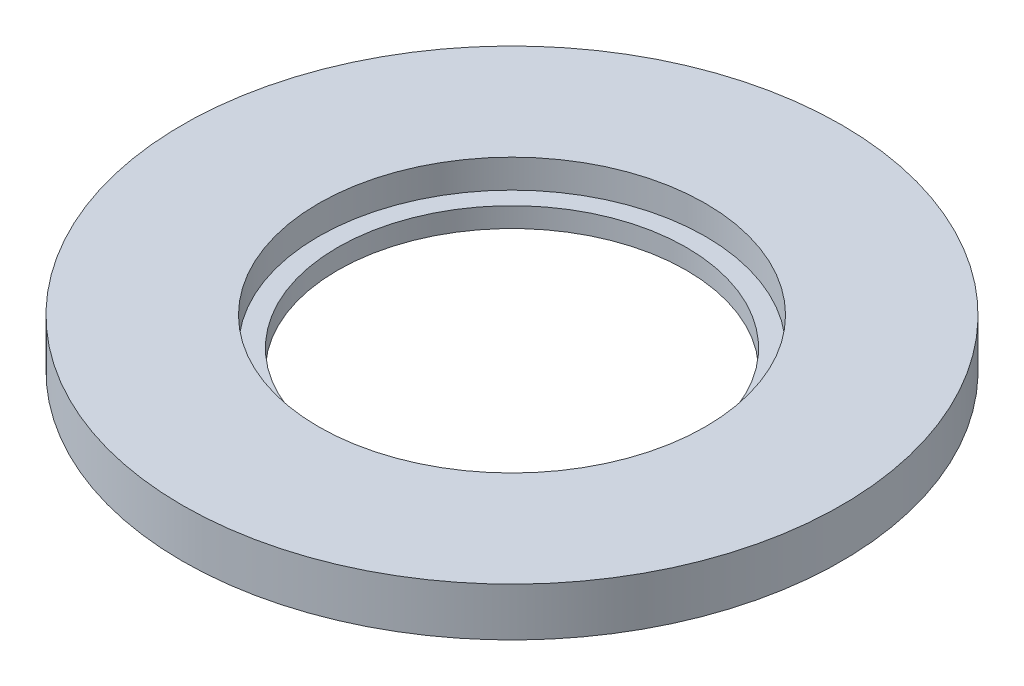
ISO-10303-21;
HEADER;
FILE_DESCRIPTION(('STEP AP214'),'2;1');
FILE_NAME('part.step','',(''),(''),'','','');
FILE_SCHEMA(('AUTOMOTIVE_DESIGN { 1 0 10303 214 1 1 1 1 }'));
ENDSEC;
DATA;
#1=APPLICATION_CONTEXT('core data for automotive mechanical design processes');
#2=APPLICATION_PROTOCOL_DEFINITION('international standard','automotive_design',2000,#1);
#3=PRODUCT_CONTEXT('',#1,'mechanical');
#4=PRODUCT('Part','Part','',(#3));
#5=PRODUCT_RELATED_PRODUCT_CATEGORY('part','',(#4));
#6=PRODUCT_DEFINITION_FORMATION('','',#4);
#7=PRODUCT_DEFINITION_CONTEXT('part definition',#1,'design');
#8=PRODUCT_DEFINITION('design','',#6,#7);
#9=PRODUCT_DEFINITION_SHAPE('','',#8);
#10=(LENGTH_UNIT() NAMED_UNIT(*) SI_UNIT(.MILLI.,.METRE.));
#11=(NAMED_UNIT(*) PLANE_ANGLE_UNIT() SI_UNIT($,.RADIAN.));
#12=(NAMED_UNIT(*) SI_UNIT($,.STERADIAN.) SOLID_ANGLE_UNIT());
#13=UNCERTAINTY_MEASURE_WITH_UNIT(LENGTH_MEASURE(1.E-05),#10,'distance_accuracy_value','');
#14=(GEOMETRIC_REPRESENTATION_CONTEXT(3) GLOBAL_UNCERTAINTY_ASSIGNED_CONTEXT((#13)) GLOBAL_UNIT_ASSIGNED_CONTEXT((#10,
#11,#12)) REPRESENTATION_CONTEXT('',''));
#15=CARTESIAN_POINT('',(0.,0.,0.));
#16=DIRECTION('',(0.,0.,1.));
#17=DIRECTION('',(1.,0.,0.));
#18=AXIS2_PLACEMENT_3D('',#15,#16,#17);
#19=CARTESIAN_POINT('',(0.,-0.500000000000003,0.));
#20=DIRECTION('',(0.,-1.,0.));
#21=DIRECTION('',(0.,0.,-1.));
#22=AXIS2_PLACEMENT_3D('',#19,#20,#21);
#23=CYLINDRICAL_SURFACE('',#22,45.8);
#24=CARTESIAN_POINT('',(0.,5.2,0.));
#25=DIRECTION('',(0.,-1.,0.));
#26=DIRECTION('',(0.,0.,-1.));
#27=AXIS2_PLACEMENT_3D('',#24,#25,#26);
#28=CIRCLE('',#27,45.8);
#29=CARTESIAN_POINT('',(0.,5.2,-45.8));
#30=VERTEX_POINT('',#29);
#31=EDGE_CURVE('E11',#30,#30,#28,.T.);
#32=ORIENTED_EDGE('',*,*,#31,.F.);
#33=EDGE_LOOP('',(#32));
#34=FACE_BOUND('',#33,.T.);
#35=CARTESIAN_POINT('',(0.,0.,0.));
#36=DIRECTION('',(0.,-1.,0.));
#37=DIRECTION('',(0.,0.,-1.));
#38=AXIS2_PLACEMENT_3D('',#35,#36,#37);
#39=CIRCLE('',#38,45.8);
#40=CARTESIAN_POINT('',(0.,0.,-45.8));
#41=VERTEX_POINT('',#40);
#42=EDGE_CURVE('E50',#41,#41,#39,.T.);
#43=ORIENTED_EDGE('',*,*,#42,.T.);
#44=EDGE_LOOP('',(#43));
#45=FACE_BOUND('',#44,.T.);
#46=ADVANCED_FACE('F36',(#34,#45),#23,.F.);
#47=CARTESIAN_POINT('',(0.,5.2,45.8));
#48=DIRECTION('',(0.,-1.,0.));
#49=DIRECTION('',(0.,0.,-1.));
#50=AXIS2_PLACEMENT_3D('',#47,#48,#49);
#51=PLANE('',#50);
#52=CARTESIAN_POINT('',(0.,5.19999999999999,0.));
#53=DIRECTION('',(0.,-1.,0.));
#54=DIRECTION('',(0.,0.,-1.));
#55=AXIS2_PLACEMENT_3D('',#52,#53,#54);
#56=CIRCLE('',#55,50.8);
#57=CARTESIAN_POINT('',(0.,5.19999999999999,-50.8));
#58=VERTEX_POINT('',#57);
#59=EDGE_CURVE('E42',#58,#58,#56,.T.);
#60=ORIENTED_EDGE('',*,*,#59,.F.);
#61=EDGE_LOOP('',(#60));
#62=FACE_BOUND('',#61,.T.);
#63=ORIENTED_EDGE('',*,*,#31,.T.);
#64=EDGE_LOOP('',(#63));
#65=FACE_BOUND('',#64,.T.);
#66=ADVANCED_FACE('F80',(#62,#65),#51,.F.);
#67=CARTESIAN_POINT('',(0.,-0.500000000000003,0.));
#68=DIRECTION('',(0.,-1.,0.));
#69=DIRECTION('',(0.,0.,-1.));
#70=AXIS2_PLACEMENT_3D('',#67,#68,#69);
#71=CYLINDRICAL_SURFACE('',#70,50.8);
#72=CARTESIAN_POINT('',(0.,12.7,0.));
#73=DIRECTION('',(0.,-1.,0.));
#74=DIRECTION('',(0.,0.,-1.));
#75=AXIS2_PLACEMENT_3D('',#72,#73,#74);
#76=CIRCLE('',#75,50.8);
#77=CARTESIAN_POINT('',(0.,12.7,-50.8));
#78=VERTEX_POINT('',#77);
#79=EDGE_CURVE('E46',#78,#78,#76,.T.);
#80=ORIENTED_EDGE('',*,*,#79,.F.);
#81=EDGE_LOOP('',(#80));
#82=FACE_BOUND('',#81,.T.);
#83=ORIENTED_EDGE('',*,*,#59,.T.);
#84=EDGE_LOOP('',(#83));
#85=FACE_BOUND('',#84,.T.);
#86=ADVANCED_FACE('F71',(#82,#85),#71,.F.);
#87=CARTESIAN_POINT('',(0.,12.7,82.55));
#88=DIRECTION('',(0.,-1.,0.));
#89=DIRECTION('',(0.,0.,-1.));
#90=AXIS2_PLACEMENT_3D('',#87,#88,#89);
#91=PLANE('',#90);
#92=ORIENTED_EDGE('',*,*,#79,.T.);
#93=EDGE_LOOP('',(#92));
#94=FACE_BOUND('',#93,.T.);
#95=CARTESIAN_POINT('',(0.,12.7,0.));
#96=DIRECTION('',(0.,-1.,0.));
#97=DIRECTION('',(0.,0.,-1.));
#98=AXIS2_PLACEMENT_3D('',#95,#96,#97);
#99=CIRCLE('',#98,86.55);
#100=CARTESIAN_POINT('',(0.,12.7,-86.55));
#101=VERTEX_POINT('',#100);
#102=EDGE_CURVE('E56',#101,#101,#99,.T.);
#103=ORIENTED_EDGE('',*,*,#102,.F.);
#104=EDGE_LOOP('',(#103));
#105=FACE_BOUND('',#104,.T.);
#106=ADVANCED_FACE('F68',(#94,#105),#91,.F.);
#107=CARTESIAN_POINT('',(0.,0.,45.8));
#108=DIRECTION('',(0.,1.,0.));
#109=DIRECTION('',(0.,0.,1.));
#110=AXIS2_PLACEMENT_3D('',#107,#108,#109);
#111=PLANE('',#110);
#112=ORIENTED_EDGE('',*,*,#42,.F.);
#113=EDGE_LOOP('',(#112));
#114=FACE_BOUND('',#113,.T.);
#115=CARTESIAN_POINT('',(0.,0.,0.));
#116=DIRECTION('',(0.,-1.,0.));
#117=DIRECTION('',(0.,0.,-1.));
#118=AXIS2_PLACEMENT_3D('',#115,#116,#117);
#119=CIRCLE('',#118,86.55);
#120=CARTESIAN_POINT('',(0.,0.,-86.55));
#121=VERTEX_POINT('',#120);
#122=EDGE_CURVE('E57',#121,#121,#119,.T.);
#123=ORIENTED_EDGE('',*,*,#122,.T.);
#124=EDGE_LOOP('',(#123));
#125=FACE_BOUND('',#124,.T.);
#126=ADVANCED_FACE('F70',(#114,#125),#111,.F.);
#127=CARTESIAN_POINT('',(0.,12.7,0.));
#128=DIRECTION('',(0.,-1.,0.));
#129=DIRECTION('',(0.,0.,-1.));
#130=AXIS2_PLACEMENT_3D('',#127,#128,#129);
#131=CYLINDRICAL_SURFACE('',#130,86.55);
#132=ORIENTED_EDGE('',*,*,#102,.T.);
#133=EDGE_LOOP('',(#132));
#134=FACE_BOUND('',#133,.T.);
#135=ORIENTED_EDGE('',*,*,#122,.F.);
#136=EDGE_LOOP('',(#135));
#137=FACE_BOUND('',#136,.T.);
#138=ADVANCED_FACE('F65',(#134,#137),#131,.T.);
#139=CLOSED_SHELL('',(#46,#66,#86,#106,#126,#138));
#140=MANIFOLD_SOLID_BREP('B2',#139);
#141=ADVANCED_BREP_SHAPE_REPRESENTATION('',(#18,#140),#14);
#142=SHAPE_DEFINITION_REPRESENTATION(#9,#141);
ENDSEC;
END-ISO-10303-21;
